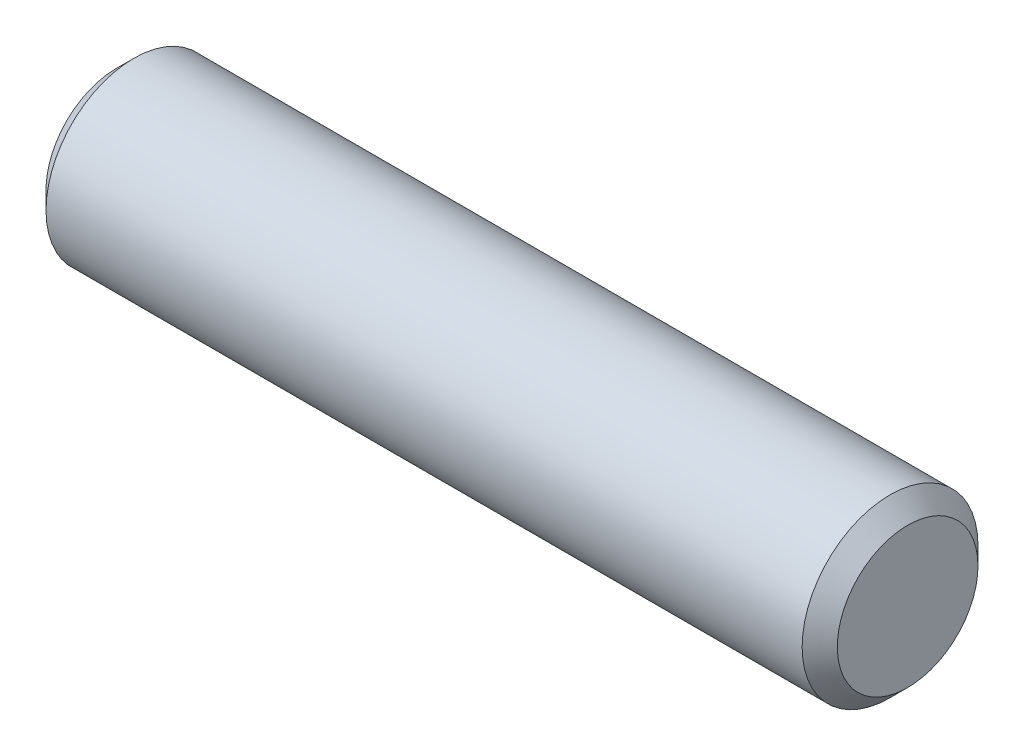
ISO-10303-21;
HEADER;
FILE_DESCRIPTION(('STEP AP214'),'2;1');
FILE_NAME('part.step','',(''),(''),'','','');
FILE_SCHEMA(('AUTOMOTIVE_DESIGN { 1 0 10303 214 1 1 1 1 }'));
ENDSEC;
DATA;
#1=APPLICATION_CONTEXT('core data for automotive mechanical design processes');
#2=APPLICATION_PROTOCOL_DEFINITION('international standard','automotive_design',2000,#1);
#3=PRODUCT_CONTEXT('',#1,'mechanical');
#4=PRODUCT('Part','Part','',(#3));
#5=PRODUCT_RELATED_PRODUCT_CATEGORY('part','',(#4));
#6=PRODUCT_DEFINITION_FORMATION('','',#4);
#7=PRODUCT_DEFINITION_CONTEXT('part definition',#1,'design');
#8=PRODUCT_DEFINITION('design','',#6,#7);
#9=PRODUCT_DEFINITION_SHAPE('','',#8);
#10=(LENGTH_UNIT() NAMED_UNIT(*) SI_UNIT(.MILLI.,.METRE.));
#11=(NAMED_UNIT(*) PLANE_ANGLE_UNIT() SI_UNIT($,.RADIAN.));
#12=(NAMED_UNIT(*) SI_UNIT($,.STERADIAN.) SOLID_ANGLE_UNIT());
#13=UNCERTAINTY_MEASURE_WITH_UNIT(LENGTH_MEASURE(1.E-05),#10,'distance_accuracy_value','');
#14=(GEOMETRIC_REPRESENTATION_CONTEXT(3) GLOBAL_UNCERTAINTY_ASSIGNED_CONTEXT((#13)) GLOBAL_UNIT_ASSIGNED_CONTEXT((#10,
#11,#12)) REPRESENTATION_CONTEXT('',''));
#15=CARTESIAN_POINT('',(0.,0.,0.));
#16=DIRECTION('',(0.,0.,1.));
#17=DIRECTION('',(1.,0.,0.));
#18=AXIS2_PLACEMENT_3D('',#15,#16,#17);
#19=CARTESIAN_POINT('',(-7.14375,0.,0.));
#20=DIRECTION('',(1.,0.,0.));
#21=DIRECTION('',(0.,0.,-1.));
#22=AXIS2_PLACEMENT_3D('',#19,#20,#21);
#23=CYLINDRICAL_SURFACE('',#22,1.5875);
#24=CARTESIAN_POINT('',(6.82625,0.,0.));
#25=DIRECTION('',(1.,0.,0.));
#26=DIRECTION('',(0.,0.,-1.));
#27=AXIS2_PLACEMENT_3D('',#24,#25,#26);
#28=CIRCLE('',#27,1.5875);
#29=CARTESIAN_POINT('',(6.82625,0.,-1.5875));
#30=VERTEX_POINT('',#29);
#31=EDGE_CURVE('E37',#30,#30,#28,.F.);
#32=ORIENTED_EDGE('',*,*,#31,.T.);
#33=EDGE_LOOP('',(#32));
#34=FACE_BOUND('',#33,.T.);
#35=CARTESIAN_POINT('',(-6.82624999999999,0.,0.));
#36=DIRECTION('',(1.,0.,0.));
#37=DIRECTION('',(0.,0.,-1.));
#38=AXIS2_PLACEMENT_3D('',#35,#36,#37);
#39=CIRCLE('',#38,1.5875);
#40=CARTESIAN_POINT('',(-6.82624999999999,0.,-1.5875));
#41=VERTEX_POINT('',#40);
#42=EDGE_CURVE('E41',#41,#41,#39,.T.);
#43=ORIENTED_EDGE('',*,*,#42,.T.);
#44=EDGE_LOOP('',(#43));
#45=FACE_BOUND('',#44,.T.);
#46=ADVANCED_FACE('F30',(#34,#45),#23,.T.);
#47=CARTESIAN_POINT('',(-7.14375,0.,0.));
#48=DIRECTION('',(1.,0.,0.));
#49=DIRECTION('',(0.,0.,-1.));
#50=AXIS2_PLACEMENT_3D('',#47,#48,#49);
#51=PLANE('',#50);
#52=CARTESIAN_POINT('',(-7.14375,0.,0.));
#53=DIRECTION('',(1.,0.,0.));
#54=DIRECTION('',(0.,0.,-1.));
#55=AXIS2_PLACEMENT_3D('',#52,#53,#54);
#56=CIRCLE('',#55,1.26999999999999);
#57=CARTESIAN_POINT('',(-7.14375,0.,-1.26999999999999));
#58=VERTEX_POINT('',#57);
#59=EDGE_CURVE('E10',#58,#58,#56,.F.);
#60=ORIENTED_EDGE('',*,*,#59,.T.);
#61=EDGE_LOOP('',(#60));
#62=FACE_BOUND('',#61,.T.);
#63=ADVANCED_FACE('F61',(#62),#51,.F.);
#64=CARTESIAN_POINT('',(7.14375,0.,0.));
#65=DIRECTION('',(1.,0.,0.));
#66=DIRECTION('',(0.,0.,-1.));
#67=AXIS2_PLACEMENT_3D('',#64,#65,#66);
#68=PLANE('',#67);
#69=CARTESIAN_POINT('',(7.14375,0.,0.));
#70=DIRECTION('',(1.,0.,0.));
#71=DIRECTION('',(0.,0.,-1.));
#72=AXIS2_PLACEMENT_3D('',#69,#70,#71);
#73=CIRCLE('',#72,1.27);
#74=CARTESIAN_POINT('',(7.14375,0.,-1.27));
#75=VERTEX_POINT('',#74);
#76=EDGE_CURVE('E45',#75,#75,#73,.T.);
#77=ORIENTED_EDGE('',*,*,#76,.T.);
#78=EDGE_LOOP('',(#77));
#79=FACE_BOUND('',#78,.T.);
#80=ADVANCED_FACE('F51',(#79),#68,.T.);
#81=CARTESIAN_POINT('',(7.14375,0.,0.));
#82=DIRECTION('',(-1.,0.,0.));
#83=DIRECTION('',(0.,0.,1.));
#84=AXIS2_PLACEMENT_3D('',#81,#82,#83);
#85=CONICAL_SURFACE('',#84,1.27,0.785398163397451);
#86=ORIENTED_EDGE('',*,*,#31,.F.);
#87=EDGE_LOOP('',(#86));
#88=FACE_BOUND('',#87,.T.);
#89=ORIENTED_EDGE('',*,*,#76,.F.);
#90=EDGE_LOOP('',(#89));
#91=FACE_BOUND('',#90,.T.);
#92=ADVANCED_FACE('F53',(#88,#91),#85,.T.);
#93=CARTESIAN_POINT('',(-6.82624999999999,0.,0.));
#94=DIRECTION('',(1.,0.,0.));
#95=DIRECTION('',(0.,0.,-1.));
#96=AXIS2_PLACEMENT_3D('',#93,#94,#95);
#97=CONICAL_SURFACE('',#96,1.5875,0.785398163397451);
#98=ORIENTED_EDGE('',*,*,#59,.F.);
#99=EDGE_LOOP('',(#98));
#100=FACE_BOUND('',#99,.T.);
#101=ORIENTED_EDGE('',*,*,#42,.F.);
#102=EDGE_LOOP('',(#101));
#103=FACE_BOUND('',#102,.T.);
#104=ADVANCED_FACE('F32',(#100,#103),#97,.T.);
#105=CLOSED_SHELL('',(#46,#63,#80,#92,#104));
#106=MANIFOLD_SOLID_BREP('B2',#105);
#107=ADVANCED_BREP_SHAPE_REPRESENTATION('',(#18,#106),#14);
#108=SHAPE_DEFINITION_REPRESENTATION(#9,#107);
ENDSEC;
END-ISO-10303-21;
